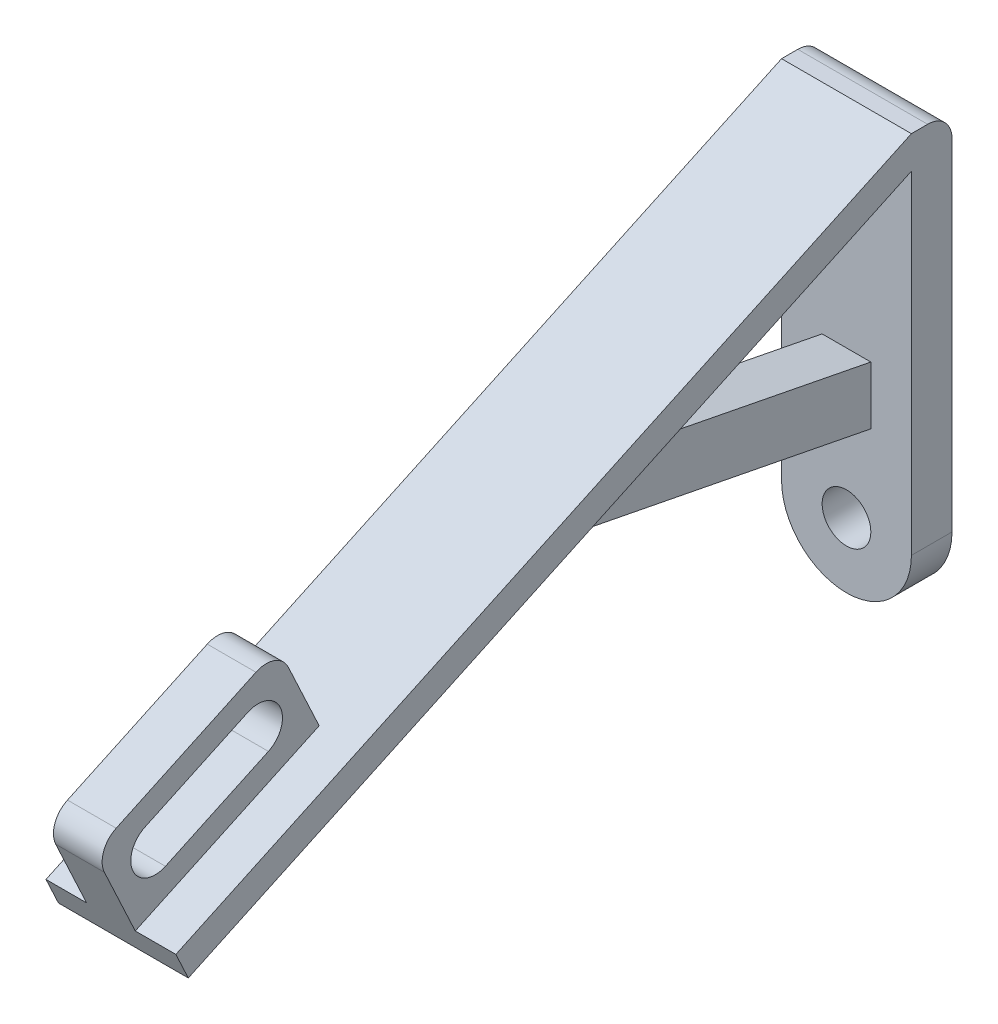
ISO-10303-21;
HEADER;
FILE_DESCRIPTION(('STEP AP214'),'2;1');
FILE_NAME('part.step','',(''),(''),'','','');
FILE_SCHEMA(('AUTOMOTIVE_DESIGN { 1 0 10303 214 1 1 1 1 }'));
ENDSEC;
DATA;
#1=APPLICATION_CONTEXT('core data for automotive mechanical design processes');
#2=APPLICATION_PROTOCOL_DEFINITION('international standard','automotive_design',2000,#1);
#3=PRODUCT_CONTEXT('',#1,'mechanical');
#4=PRODUCT('Part','Part','',(#3));
#5=PRODUCT_RELATED_PRODUCT_CATEGORY('part','',(#4));
#6=PRODUCT_DEFINITION_FORMATION('','',#4);
#7=PRODUCT_DEFINITION_CONTEXT('part definition',#1,'design');
#8=PRODUCT_DEFINITION('design','',#6,#7);
#9=PRODUCT_DEFINITION_SHAPE('','',#8);
#10=(LENGTH_UNIT() NAMED_UNIT(*) SI_UNIT(.MILLI.,.METRE.));
#11=(NAMED_UNIT(*) PLANE_ANGLE_UNIT() SI_UNIT($,.RADIAN.));
#12=(NAMED_UNIT(*) SI_UNIT($,.STERADIAN.) SOLID_ANGLE_UNIT());
#13=UNCERTAINTY_MEASURE_WITH_UNIT(LENGTH_MEASURE(1.E-05),#10,'distance_accuracy_value','');
#14=(GEOMETRIC_REPRESENTATION_CONTEXT(3) GLOBAL_UNCERTAINTY_ASSIGNED_CONTEXT((#13)) GLOBAL_UNIT_ASSIGNED_CONTEXT((#10,
#11,#12)) REPRESENTATION_CONTEXT('',''));
#15=CARTESIAN_POINT('',(0.,0.,0.));
#16=DIRECTION('',(0.,0.,1.));
#17=DIRECTION('',(1.,0.,0.));
#18=AXIS2_PLACEMENT_3D('',#15,#16,#17);
#19=CARTESIAN_POINT('',(0.,0.,5.));
#20=DIRECTION('',(0.,0.,1.));
#21=DIRECTION('',(1.,0.,0.));
#22=AXIS2_PLACEMENT_3D('',#19,#20,#21);
#23=PLANE('',#22);
#24=DIRECTION('',(0.,1.,0.));
#25=VECTOR('',#24,1.);
#26=CARTESIAN_POINT('',(-3.,18.1328109612648,5.));
#27=LINE('',#26,#25);
#28=CARTESIAN_POINT('',(-3.,11.,5.));
#29=VERTEX_POINT('',#28);
#30=CARTESIAN_POINT('',(-3.,18.1328109612648,5.));
#31=VERTEX_POINT('',#30);
#32=EDGE_CURVE('E257',#29,#31,#27,.T.);
#33=ORIENTED_EDGE('',*,*,#32,.T.);
#34=DIRECTION('',(1.,0.,0.));
#35=VECTOR('',#34,1.);
#36=CARTESIAN_POINT('',(-3.,18.1328109612648,5.));
#37=LINE('',#36,#35);
#38=CARTESIAN_POINT('',(3.,18.1328109612648,5.));
#39=VERTEX_POINT('',#38);
#40=EDGE_CURVE('E269',#31,#39,#37,.T.);
#41=ORIENTED_EDGE('',*,*,#40,.T.);
#42=DIRECTION('',(0.,1.,0.));
#43=VECTOR('',#42,1.);
#44=CARTESIAN_POINT('',(3.,18.1328109612648,5.));
#45=LINE('',#44,#43);
#46=CARTESIAN_POINT('',(3.,11.,5.));
#47=VERTEX_POINT('',#46);
#48=EDGE_CURVE('E248',#47,#39,#45,.T.);
#49=ORIENTED_EDGE('',*,*,#48,.F.);
#50=DIRECTION('',(1.,0.,0.));
#51=VECTOR('',#50,1.);
#52=CARTESIAN_POINT('',(-3.,11.,5.));
#53=LINE('',#52,#51);
#54=EDGE_CURVE('E270',#29,#47,#53,.T.);
#55=ORIENTED_EDGE('',*,*,#54,.F.);
#56=EDGE_LOOP('',(#33,#41,#49,#55));
#57=FACE_BOUND('',#56,.T.);
#58=CARTESIAN_POINT('',(0.,0.,5.));
#59=DIRECTION('',(0.,0.,1.));
#60=DIRECTION('',(1.,0.,0.));
#61=AXIS2_PLACEMENT_3D('',#58,#59,#60);
#62=CIRCLE('',#61,3.);
#63=CARTESIAN_POINT('',(3.,0.,5.));
#64=VERTEX_POINT('',#63);
#65=EDGE_CURVE('E308',#64,#64,#62,.T.);
#66=ORIENTED_EDGE('',*,*,#65,.F.);
#67=EDGE_LOOP('',(#66));
#68=FACE_BOUND('',#67,.T.);
#69=DIRECTION('',(0.,1.,0.));
#70=VECTOR('',#69,1.);
#71=CARTESIAN_POINT('',(8.,0.,5.));
#72=LINE('',#71,#70);
#73=CARTESIAN_POINT('',(8.,0.,5.));
#74=VERTEX_POINT('',#73);
#75=CARTESIAN_POINT('',(8.,41.,5.));
#76=VERTEX_POINT('',#75);
#77=EDGE_CURVE('E317',#74,#76,#72,.T.);
#78=ORIENTED_EDGE('',*,*,#77,.T.);
#79=DIRECTION('',(-1.,0.,0.));
#80=VECTOR('',#79,1.);
#81=CARTESIAN_POINT('',(8.,41.,5.));
#82=LINE('',#81,#80);
#83=CARTESIAN_POINT('',(-8.,41.,5.));
#84=VERTEX_POINT('',#83);
#85=EDGE_CURVE('E302',#76,#84,#82,.T.);
#86=ORIENTED_EDGE('',*,*,#85,.T.);
#87=DIRECTION('',(0.,-1.,0.));
#88=VECTOR('',#87,1.);
#89=CARTESIAN_POINT('',(-8.,0.,5.));
#90=LINE('',#89,#88);
#91=CARTESIAN_POINT('',(-8.,0.,5.));
#92=VERTEX_POINT('',#91);
#93=EDGE_CURVE('E323',#84,#92,#90,.T.);
#94=ORIENTED_EDGE('',*,*,#93,.T.);
#95=CARTESIAN_POINT('',(0.,0.,5.));
#96=DIRECTION('',(0.,0.,1.));
#97=DIRECTION('',(1.,0.,0.));
#98=AXIS2_PLACEMENT_3D('',#95,#96,#97);
#99=CIRCLE('',#98,8.);
#100=EDGE_CURVE('E314',#92,#74,#99,.T.);
#101=ORIENTED_EDGE('',*,*,#100,.T.);
#102=EDGE_LOOP('',(#78,#86,#94,#101));
#103=FACE_BOUND('',#102,.T.);
#104=ADVANCED_FACE('F33',(#57,#68,#103),#23,.T.);
#105=CARTESIAN_POINT('',(0.,0.,0.));
#106=DIRECTION('',(0.,0.,1.));
#107=DIRECTION('',(1.,0.,0.));
#108=AXIS2_PLACEMENT_3D('',#105,#106,#107);
#109=PLANE('',#108);
#110=DIRECTION('',(0.,-1.,0.));
#111=VECTOR('',#110,1.);
#112=CARTESIAN_POINT('',(-8.,0.,0.));
#113=LINE('',#112,#111);
#114=CARTESIAN_POINT('',(-8.,42.,0.));
#115=VERTEX_POINT('',#114);
#116=CARTESIAN_POINT('',(-8.,0.,0.));
#117=VERTEX_POINT('',#116);
#118=EDGE_CURVE('E318',#115,#117,#113,.T.);
#119=ORIENTED_EDGE('',*,*,#118,.F.);
#120=DIRECTION('',(-1.,0.,0.));
#121=VECTOR('',#120,1.);
#122=CARTESIAN_POINT('',(0.,42.,0.));
#123=LINE('',#122,#121);
#124=CARTESIAN_POINT('',(8.,42.,0.));
#125=VERTEX_POINT('',#124);
#126=EDGE_CURVE('E41',#115,#125,#123,.F.);
#127=ORIENTED_EDGE('',*,*,#126,.T.);
#128=DIRECTION('',(0.,1.,0.));
#129=VECTOR('',#128,1.);
#130=CARTESIAN_POINT('',(8.,0.,0.));
#131=LINE('',#130,#129);
#132=CARTESIAN_POINT('',(8.,0.,0.));
#133=VERTEX_POINT('',#132);
#134=EDGE_CURVE('E328',#133,#125,#131,.T.);
#135=ORIENTED_EDGE('',*,*,#134,.F.);
#136=CARTESIAN_POINT('',(0.,0.,0.));
#137=DIRECTION('',(0.,0.,1.));
#138=DIRECTION('',(1.,0.,0.));
#139=AXIS2_PLACEMENT_3D('',#136,#137,#138);
#140=CIRCLE('',#139,8.);
#141=EDGE_CURVE('E311',#117,#133,#140,.T.);
#142=ORIENTED_EDGE('',*,*,#141,.F.);
#143=EDGE_LOOP('',(#119,#127,#135,#142));
#144=FACE_BOUND('',#143,.T.);
#145=CARTESIAN_POINT('',(0.,0.,0.));
#146=DIRECTION('',(0.,0.,1.));
#147=DIRECTION('',(1.,0.,0.));
#148=AXIS2_PLACEMENT_3D('',#145,#146,#147);
#149=CIRCLE('',#148,3.);
#150=CARTESIAN_POINT('',(3.,0.,0.));
#151=VERTEX_POINT('',#150);
#152=EDGE_CURVE('E301',#151,#151,#149,.T.);
#153=ORIENTED_EDGE('',*,*,#152,.T.);
#154=EDGE_LOOP('',(#153));
#155=FACE_BOUND('',#154,.T.);
#156=ADVANCED_FACE('F389',(#144,#155),#109,.F.);
#157=CARTESIAN_POINT('',(0.,0.,5.));
#158=DIRECTION('',(0.,0.,-1.));
#159=DIRECTION('',(-1.,0.,0.));
#160=AXIS2_PLACEMENT_3D('',#157,#158,#159);
#161=CYLINDRICAL_SURFACE('',#160,8.);
#162=ORIENTED_EDGE('',*,*,#141,.T.);
#163=DIRECTION('',(0.,0.,-1.));
#164=VECTOR('',#163,1.);
#165=CARTESIAN_POINT('',(8.,0.,5.));
#166=LINE('',#165,#164);
#167=EDGE_CURVE('E338',#74,#133,#166,.T.);
#168=ORIENTED_EDGE('',*,*,#167,.F.);
#169=ORIENTED_EDGE('',*,*,#100,.F.);
#170=DIRECTION('',(0.,0.,-1.));
#171=VECTOR('',#170,1.);
#172=CARTESIAN_POINT('',(-8.,0.,5.));
#173=LINE('',#172,#171);
#174=EDGE_CURVE('E325',#92,#117,#173,.T.);
#175=ORIENTED_EDGE('',*,*,#174,.T.);
#176=EDGE_LOOP('',(#162,#168,#169,#175));
#177=FACE_BOUND('',#176,.T.);
#178=ADVANCED_FACE('F395',(#177),#161,.T.);
#179=CARTESIAN_POINT('',(8.,0.,5.));
#180=DIRECTION('',(-1.,0.,0.));
#181=DIRECTION('',(0.,0.,1.));
#182=AXIS2_PLACEMENT_3D('',#179,#180,#181);
#183=PLANE('',#182);
#184=ORIENTED_EDGE('',*,*,#134,.T.);
#185=CARTESIAN_POINT('',(8.,42.,3.));
#186=DIRECTION('',(-1.,0.,0.));
#187=DIRECTION('',(0.,0.,1.));
#188=AXIS2_PLACEMENT_3D('',#185,#186,#187);
#189=CIRCLE('',#188,3.);
#190=CARTESIAN_POINT('',(8.,45.,3.));
#191=VERTEX_POINT('',#190);
#192=EDGE_CURVE('E11',#125,#191,#189,.F.);
#193=ORIENTED_EDGE('',*,*,#192,.T.);
#194=DIRECTION('',(0.,0.,-1.));
#195=VECTOR('',#194,1.);
#196=CARTESIAN_POINT('',(8.,45.,5.));
#197=LINE('',#196,#195);
#198=CARTESIAN_POINT('',(8.,45.,5.));
#199=VERTEX_POINT('',#198);
#200=EDGE_CURVE('E335',#199,#191,#197,.T.);
#201=ORIENTED_EDGE('',*,*,#200,.F.);
#202=DIRECTION('',(0.,0.422618261740704,-0.906307787036648));
#203=VECTOR('',#202,1.);
#204=CARTESIAN_POINT('',(8.,45.,5.));
#205=LINE('',#204,#203);
#206=CARTESIAN_POINT('',(8.,2.73817382592963,95.6307787036648));
#207=VERTEX_POINT('',#206);
#208=EDGE_CURVE('E285',#207,#199,#205,.T.);
#209=ORIENTED_EDGE('',*,*,#208,.F.);
#210=DIRECTION('',(0.,0.906307787036648,0.422618261740703));
#211=VECTOR('',#210,1.);
#212=CARTESIAN_POINT('',(8.,2.73817382592963,95.6307787036648));
#213=LINE('',#212,#211);
#214=CARTESIAN_POINT('',(8.,-0.547401393443451,94.0986898174268));
#215=VERTEX_POINT('',#214);
#216=EDGE_CURVE('E282',#215,#207,#213,.T.);
#217=ORIENTED_EDGE('',*,*,#216,.F.);
#218=DIRECTION('',(0.,-0.422618261740704,0.906307787036648));
#219=VECTOR('',#218,1.);
#220=CARTESIAN_POINT('',(8.,-0.547401393443451,94.0986898174268));
#221=LINE('',#220,#219);
#222=EDGE_CURVE('E288',#76,#215,#221,.T.);
#223=ORIENTED_EDGE('',*,*,#222,.F.);
#224=ORIENTED_EDGE('',*,*,#77,.F.);
#225=ORIENTED_EDGE('',*,*,#167,.T.);
#226=EDGE_LOOP('',(#184,#193,#201,#209,#217,#223,#224,#225));
#227=FACE_BOUND('',#226,.T.);
#228=ADVANCED_FACE('F380',(#227),#183,.F.);
#229=CARTESIAN_POINT('',(-8.,45.,5.));
#230=DIRECTION('',(0.,-1.,0.));
#231=DIRECTION('',(0.,0.,-1.));
#232=AXIS2_PLACEMENT_3D('',#229,#230,#231);
#233=PLANE('',#232);
#234=ORIENTED_EDGE('',*,*,#200,.T.);
#235=DIRECTION('',(-1.,0.,0.));
#236=VECTOR('',#235,1.);
#237=CARTESIAN_POINT('',(-8.,45.,3.));
#238=LINE('',#237,#236);
#239=CARTESIAN_POINT('',(-8.,45.,3.));
#240=VERTEX_POINT('',#239);
#241=EDGE_CURVE('E359',#191,#240,#238,.T.);
#242=ORIENTED_EDGE('',*,*,#241,.T.);
#243=DIRECTION('',(0.,0.,-1.));
#244=VECTOR('',#243,1.);
#245=CARTESIAN_POINT('',(-8.,45.,5.));
#246=LINE('',#245,#244);
#247=CARTESIAN_POINT('',(-8.,45.,5.));
#248=VERTEX_POINT('',#247);
#249=EDGE_CURVE('E333',#248,#240,#246,.T.);
#250=ORIENTED_EDGE('',*,*,#249,.F.);
#251=DIRECTION('',(-1.,0.,0.));
#252=VECTOR('',#251,1.);
#253=CARTESIAN_POINT('',(-8.,45.,5.));
#254=LINE('',#253,#252);
#255=EDGE_CURVE('E321',#199,#248,#254,.T.);
#256=ORIENTED_EDGE('',*,*,#255,.F.);
#257=EDGE_LOOP('',(#234,#242,#250,#256));
#258=FACE_BOUND('',#257,.T.);
#259=ADVANCED_FACE('F365',(#258),#233,.F.);
#260=CARTESIAN_POINT('',(-8.,0.,5.));
#261=DIRECTION('',(1.,0.,0.));
#262=DIRECTION('',(0.,0.,-1.));
#263=AXIS2_PLACEMENT_3D('',#260,#261,#262);
#264=PLANE('',#263);
#265=ORIENTED_EDGE('',*,*,#249,.T.);
#266=CARTESIAN_POINT('',(-8.,42.,3.));
#267=DIRECTION('',(1.,0.,0.));
#268=DIRECTION('',(0.,0.,-1.));
#269=AXIS2_PLACEMENT_3D('',#266,#267,#268);
#270=CIRCLE('',#269,3.);
#271=EDGE_CURVE('E55',#240,#115,#270,.F.);
#272=ORIENTED_EDGE('',*,*,#271,.T.);
#273=ORIENTED_EDGE('',*,*,#118,.T.);
#274=ORIENTED_EDGE('',*,*,#174,.F.);
#275=ORIENTED_EDGE('',*,*,#93,.F.);
#276=DIRECTION('',(0.,-0.422618261740704,0.906307787036648));
#277=VECTOR('',#276,1.);
#278=CARTESIAN_POINT('',(-8.,-0.547401393443451,94.0986898174268));
#279=LINE('',#278,#277);
#280=CARTESIAN_POINT('',(-8.,-0.547401393443451,94.0986898174268));
#281=VERTEX_POINT('',#280);
#282=EDGE_CURVE('E286',#84,#281,#279,.T.);
#283=ORIENTED_EDGE('',*,*,#282,.T.);
#284=DIRECTION('',(0.,0.906307787036648,0.422618261740703));
#285=VECTOR('',#284,1.);
#286=CARTESIAN_POINT('',(-8.,2.73817382592963,95.6307787036648));
#287=LINE('',#286,#285);
#288=CARTESIAN_POINT('',(-8.,2.73817382592963,95.6307787036648));
#289=VERTEX_POINT('',#288);
#290=EDGE_CURVE('E273',#281,#289,#287,.T.);
#291=ORIENTED_EDGE('',*,*,#290,.T.);
#292=DIRECTION('',(0.,0.422618261740704,-0.906307787036648));
#293=VECTOR('',#292,1.);
#294=CARTESIAN_POINT('',(-8.,45.,5.));
#295=LINE('',#294,#293);
#296=EDGE_CURVE('E294',#289,#248,#295,.T.);
#297=ORIENTED_EDGE('',*,*,#296,.T.);
#298=EDGE_LOOP('',(#265,#272,#273,#274,#275,#283,#291,#297));
#299=FACE_BOUND('',#298,.T.);
#300=ADVANCED_FACE('F370',(#299),#264,.F.);
#301=CARTESIAN_POINT('',(0.,0.,5.));
#302=DIRECTION('',(0.,0.,-1.));
#303=DIRECTION('',(-1.,0.,0.));
#304=AXIS2_PLACEMENT_3D('',#301,#302,#303);
#305=CYLINDRICAL_SURFACE('',#304,3.);
#306=ORIENTED_EDGE('',*,*,#65,.T.);
#307=EDGE_LOOP('',(#306));
#308=FACE_BOUND('',#307,.T.);
#309=ORIENTED_EDGE('',*,*,#152,.F.);
#310=EDGE_LOOP('',(#309));
#311=FACE_BOUND('',#310,.T.);
#312=ADVANCED_FACE('F399',(#308,#311),#305,.F.);
#313=CARTESIAN_POINT('',(8.,2.73817382592963,95.6307787036648));
#314=DIRECTION('',(0.,-0.422618261740703,0.906307787036648));
#315=DIRECTION('',(0.,-0.906307787036648,-0.422618261740703));
#316=AXIS2_PLACEMENT_3D('',#313,#314,#315);
#317=PLANE('',#316);
#318=DIRECTION('',(0.,-0.906307787036648,-0.422618261740703));
#319=VECTOR('',#318,1.);
#320=CARTESIAN_POINT('',(3.,2.73817382592963,95.6307787036648));
#321=LINE('',#320,#319);
#322=CARTESIAN_POINT('',(3.,10.8949439092595,99.4343430593311));
#323=VERTEX_POINT('',#322);
#324=CARTESIAN_POINT('',(3.,2.73817382592963,95.6307787036648));
#325=VERTEX_POINT('',#324);
#326=EDGE_CURVE('E220',#323,#325,#321,.T.);
#327=ORIENTED_EDGE('',*,*,#326,.F.);
#328=DIRECTION('',(1.,0.,0.));
#329=VECTOR('',#328,1.);
#330=CARTESIAN_POINT('',(8.,10.8949439092595,99.4343430593311));
#331=LINE('',#330,#329);
#332=CARTESIAN_POINT('',(-3.,10.8949439092595,99.4343430593311));
#333=VERTEX_POINT('',#332);
#334=EDGE_CURVE('E350',#323,#333,#331,.F.);
#335=ORIENTED_EDGE('',*,*,#334,.T.);
#336=DIRECTION('',(0.,-0.906307787036648,-0.422618261740703));
#337=VECTOR('',#336,1.);
#338=CARTESIAN_POINT('',(-3.,2.73817382592963,95.6307787036648));
#339=LINE('',#338,#337);
#340=CARTESIAN_POINT('',(-3.,2.73817382592963,95.6307787036648));
#341=VERTEX_POINT('',#340);
#342=EDGE_CURVE('E243',#333,#341,#339,.T.);
#343=ORIENTED_EDGE('',*,*,#342,.T.);
#344=DIRECTION('',(-1.,0.,0.));
#345=VECTOR('',#344,1.);
#346=CARTESIAN_POINT('',(8.,2.73817382592963,95.6307787036648));
#347=LINE('',#346,#345);
#348=EDGE_CURVE('E291',#341,#289,#347,.T.);
#349=ORIENTED_EDGE('',*,*,#348,.T.);
#350=ORIENTED_EDGE('',*,*,#290,.F.);
#351=DIRECTION('',(-1.,0.,0.));
#352=VECTOR('',#351,1.);
#353=CARTESIAN_POINT('',(8.,-0.547401393443451,94.0986898174268));
#354=LINE('',#353,#352);
#355=EDGE_CURVE('E299',#215,#281,#354,.T.);
#356=ORIENTED_EDGE('',*,*,#355,.F.);
#357=ORIENTED_EDGE('',*,*,#216,.T.);
#358=EDGE_CURVE('E305',#207,#325,#347,.T.);
#359=ORIENTED_EDGE('',*,*,#358,.T.);
#360=EDGE_LOOP('',(#327,#335,#343,#349,#350,#356,#357,#359));
#361=FACE_BOUND('',#360,.T.);
#362=ADVANCED_FACE('F437',(#361),#317,.T.);
#363=CARTESIAN_POINT('',(8.,-0.547401393443451,94.0986898174268));
#364=DIRECTION('',(0.,-0.906307787036648,-0.422618261740704));
#365=DIRECTION('',(0.,0.422618261740704,-0.906307787036648));
#366=AXIS2_PLACEMENT_3D('',#363,#364,#365);
#367=PLANE('',#366);
#368=DIRECTION('',(0.,-0.422618261740704,0.906307787036648));
#369=VECTOR('',#368,1.);
#370=CARTESIAN_POINT('',(-3.,24.8931805292561,39.5411858224079));
#371=LINE('',#370,#369);
#372=CARTESIAN_POINT('',(-3.,24.8931805292561,39.5411858224079));
#373=VERTEX_POINT('',#372);
#374=CARTESIAN_POINT('',(-3.,19.8690869129648,50.3153893518324));
#375=VERTEX_POINT('',#374);
#376=EDGE_CURVE('E263',#373,#375,#371,.T.);
#377=ORIENTED_EDGE('',*,*,#376,.T.);
#378=DIRECTION('',(1.,0.,0.));
#379=VECTOR('',#378,1.);
#380=CARTESIAN_POINT('',(-3.,19.8690869129648,50.3153893518324));
#381=LINE('',#380,#379);
#382=CARTESIAN_POINT('',(3.,19.8690869129648,50.3153893518324));
#383=VERTEX_POINT('',#382);
#384=EDGE_CURVE('E274',#375,#383,#381,.T.);
#385=ORIENTED_EDGE('',*,*,#384,.T.);
#386=DIRECTION('',(0.,-0.422618261740704,0.906307787036648));
#387=VECTOR('',#386,1.);
#388=CARTESIAN_POINT('',(3.,24.8931805292561,39.5411858224079));
#389=LINE('',#388,#387);
#390=CARTESIAN_POINT('',(3.,24.8931805292561,39.5411858224079));
#391=VERTEX_POINT('',#390);
#392=EDGE_CURVE('E253',#391,#383,#389,.T.);
#393=ORIENTED_EDGE('',*,*,#392,.F.);
#394=DIRECTION('',(1.,0.,0.));
#395=VECTOR('',#394,1.);
#396=CARTESIAN_POINT('',(-3.,24.8931805292561,39.5411858224079));
#397=LINE('',#396,#395);
#398=EDGE_CURVE('E277',#373,#391,#397,.T.);
#399=ORIENTED_EDGE('',*,*,#398,.F.);
#400=EDGE_LOOP('',(#377,#385,#393,#399));
#401=FACE_BOUND('',#400,.T.);
#402=ORIENTED_EDGE('',*,*,#282,.F.);
#403=ORIENTED_EDGE('',*,*,#85,.F.);
#404=ORIENTED_EDGE('',*,*,#222,.T.);
#405=ORIENTED_EDGE('',*,*,#355,.T.);
#406=EDGE_LOOP('',(#402,#403,#404,#405));
#407=FACE_BOUND('',#406,.T.);
#408=ADVANCED_FACE('F440',(#401,#407),#367,.T.);
#409=CARTESIAN_POINT('',(8.,45.,5.));
#410=DIRECTION('',(0.,0.906307787036648,0.422618261740704));
#411=DIRECTION('',(0.,-0.422618261740704,0.906307787036648));
#412=AXIS2_PLACEMENT_3D('',#409,#410,#411);
#413=PLANE('',#412);
#414=DIRECTION('',(0.,0.422618261740704,-0.906307787036648));
#415=VECTOR('',#414,1.);
#416=CARTESIAN_POINT('',(-3.,13.3036303694472,72.9730840277486));
#417=LINE('',#416,#415);
#418=CARTESIAN_POINT('',(-3.,13.3036303694472,72.9730840277486));
#419=VERTEX_POINT('',#418);
#420=EDGE_CURVE('E231',#341,#419,#417,.T.);
#421=ORIENTED_EDGE('',*,*,#420,.T.);
#422=DIRECTION('',(1.,0.,0.));
#423=VECTOR('',#422,1.);
#424=CARTESIAN_POINT('',(-3.,13.3036303694472,72.9730840277486));
#425=LINE('',#424,#423);
#426=CARTESIAN_POINT('',(3.,13.3036303694472,72.9730840277486));
#427=VERTEX_POINT('',#426);
#428=EDGE_CURVE('E245',#419,#427,#425,.T.);
#429=ORIENTED_EDGE('',*,*,#428,.T.);
#430=DIRECTION('',(0.,0.422618261740704,-0.906307787036648));
#431=VECTOR('',#430,1.);
#432=CARTESIAN_POINT('',(3.,13.3036303694472,72.9730840277486));
#433=LINE('',#432,#431);
#434=EDGE_CURVE('E211',#325,#427,#433,.T.);
#435=ORIENTED_EDGE('',*,*,#434,.F.);
#436=ORIENTED_EDGE('',*,*,#358,.F.);
#437=ORIENTED_EDGE('',*,*,#208,.T.);
#438=ORIENTED_EDGE('',*,*,#255,.T.);
#439=ORIENTED_EDGE('',*,*,#296,.F.);
#440=ORIENTED_EDGE('',*,*,#348,.F.);
#441=EDGE_LOOP('',(#421,#429,#435,#436,#437,#438,#439,#440));
#442=FACE_BOUND('',#441,.T.);
#443=ADVANCED_FACE('F375',(#442),#413,.T.);
#444=CARTESIAN_POINT('',(-3.,11.,5.));
#445=DIRECTION('',(0.,-0.981380277426938,0.192074858004438));
#446=DIRECTION('',(0.,-0.192074858004438,-0.981380277426939));
#447=AXIS2_PLACEMENT_3D('',#444,#445,#446);
#448=PLANE('',#447);
#449=ORIENTED_EDGE('',*,*,#54,.T.);
#450=DIRECTION('',(0.,-0.192074858004438,-0.981380277426938));
#451=VECTOR('',#450,1.);
#452=CARTESIAN_POINT('',(3.,11.,5.));
#453=LINE('',#452,#451);
#454=EDGE_CURVE('E255',#383,#47,#453,.T.);
#455=ORIENTED_EDGE('',*,*,#454,.F.);
#456=ORIENTED_EDGE('',*,*,#384,.F.);
#457=DIRECTION('',(0.,-0.192074858004438,-0.981380277426938));
#458=VECTOR('',#457,1.);
#459=CARTESIAN_POINT('',(-3.,11.,5.));
#460=LINE('',#459,#458);
#461=EDGE_CURVE('E266',#375,#29,#460,.T.);
#462=ORIENTED_EDGE('',*,*,#461,.T.);
#463=EDGE_LOOP('',(#449,#455,#456,#462));
#464=FACE_BOUND('',#463,.T.);
#465=ADVANCED_FACE('F463',(#464),#448,.T.);
#466=CARTESIAN_POINT('',(-3.,18.1328109612648,5.));
#467=DIRECTION('',(0.,0.981380277426938,-0.192074858004438));
#468=DIRECTION('',(0.,0.192074858004438,0.981380277426939));
#469=AXIS2_PLACEMENT_3D('',#466,#467,#468);
#470=PLANE('',#469);
#471=ORIENTED_EDGE('',*,*,#398,.T.);
#472=DIRECTION('',(0.,0.192074858004438,0.981380277426939));
#473=VECTOR('',#472,1.);
#474=CARTESIAN_POINT('',(3.,18.1328109612648,5.));
#475=LINE('',#474,#473);
#476=EDGE_CURVE('E251',#39,#391,#475,.T.);
#477=ORIENTED_EDGE('',*,*,#476,.F.);
#478=ORIENTED_EDGE('',*,*,#40,.F.);
#479=DIRECTION('',(0.,0.192074858004438,0.981380277426939));
#480=VECTOR('',#479,1.);
#481=CARTESIAN_POINT('',(-3.,18.1328109612648,5.));
#482=LINE('',#481,#480);
#483=EDGE_CURVE('E260',#31,#373,#482,.T.);
#484=ORIENTED_EDGE('',*,*,#483,.T.);
#485=EDGE_LOOP('',(#471,#477,#478,#484));
#486=FACE_BOUND('',#485,.T.);
#487=ADVANCED_FACE('F465',(#486),#470,.T.);
#488=CARTESIAN_POINT('',(-3.,0.,0.));
#489=DIRECTION('',(-1.,0.,0.));
#490=DIRECTION('',(0.,0.,1.));
#491=AXIS2_PLACEMENT_3D('',#488,#489,#490);
#492=PLANE('',#491);
#493=ORIENTED_EDGE('',*,*,#32,.F.);
#494=ORIENTED_EDGE('',*,*,#461,.F.);
#495=ORIENTED_EDGE('',*,*,#376,.F.);
#496=ORIENTED_EDGE('',*,*,#483,.F.);
#497=EDGE_LOOP('',(#493,#494,#495,#496));
#498=FACE_BOUND('',#497,.T.);
#499=ADVANCED_FACE('F468',(#498),#492,.T.);
#500=CARTESIAN_POINT('',(3.,0.,0.));
#501=DIRECTION('',(-1.,0.,0.));
#502=DIRECTION('',(0.,0.,1.));
#503=AXIS2_PLACEMENT_3D('',#500,#501,#502);
#504=PLANE('',#503);
#505=ORIENTED_EDGE('',*,*,#48,.T.);
#506=ORIENTED_EDGE('',*,*,#476,.T.);
#507=ORIENTED_EDGE('',*,*,#392,.T.);
#508=ORIENTED_EDGE('',*,*,#454,.T.);
#509=EDGE_LOOP('',(#505,#506,#507,#508));
#510=FACE_BOUND('',#509,.T.);
#511=ADVANCED_FACE('F475',(#510),#504,.F.);
#512=CARTESIAN_POINT('',(-3.,13.6138672703694,100.702197844553));
#513=DIRECTION('',(0.,0.906307787036648,0.422618261740704));
#514=DIRECTION('',(0.,-0.422618261740704,0.906307787036648));
#515=AXIS2_PLACEMENT_3D('',#512,#513,#514);
#516=PLANE('',#515);
#517=DIRECTION('',(0.,-0.422618261740704,0.906307787036648));
#518=VECTOR('',#517,1.);
#519=CARTESIAN_POINT('',(-3.,13.6138672703694,100.702197844553));
#520=LINE('',#519,#518);
#521=CARTESIAN_POINT('',(-3.,22.9114690286649,80.763426529747));
#522=VERTEX_POINT('',#521);
#523=CARTESIAN_POINT('',(-3.,14.8817220555915,97.9832744834433));
#524=VERTEX_POINT('',#523);
#525=EDGE_CURVE('E240',#522,#524,#520,.T.);
#526=ORIENTED_EDGE('',*,*,#525,.T.);
#527=DIRECTION('',(1.,0.,0.));
#528=VECTOR('',#527,1.);
#529=CARTESIAN_POINT('',(-3.,14.8817220555915,97.9832744834433));
#530=LINE('',#529,#528);
#531=CARTESIAN_POINT('',(3.,14.8817220555915,97.9832744834433));
#532=VERTEX_POINT('',#531);
#533=EDGE_CURVE('E343',#524,#532,#530,.T.);
#534=ORIENTED_EDGE('',*,*,#533,.T.);
#535=DIRECTION('',(0.,-0.422618261740704,0.906307787036648));
#536=VECTOR('',#535,1.);
#537=CARTESIAN_POINT('',(3.,13.6138672703694,100.702197844553));
#538=LINE('',#537,#536);
#539=CARTESIAN_POINT('',(3.,22.9114690286649,80.763426529747));
#540=VERTEX_POINT('',#539);
#541=EDGE_CURVE('E217',#540,#532,#538,.T.);
#542=ORIENTED_EDGE('',*,*,#541,.F.);
#543=DIRECTION('',(1.,0.,0.));
#544=VECTOR('',#543,1.);
#545=CARTESIAN_POINT('',(-3.,22.9114690286649,80.763426529747));
#546=LINE('',#545,#544);
#547=EDGE_CURVE('E341',#540,#522,#546,.F.);
#548=ORIENTED_EDGE('',*,*,#547,.T.);
#549=EDGE_LOOP('',(#526,#534,#542,#548));
#550=FACE_BOUND('',#549,.T.);
#551=ADVANCED_FACE('F428',(#550),#516,.T.);
#552=CARTESIAN_POINT('',(-3.,24.179323813887,78.0445031686371));
#553=DIRECTION('',(0.,0.422618261740703,-0.906307787036648));
#554=DIRECTION('',(0.,0.906307787036648,0.422618261740703));
#555=AXIS2_PLACEMENT_3D('',#552,#553,#554);
#556=PLANE('',#555);
#557=DIRECTION('',(0.,0.906307787036648,0.422618261740703));
#558=VECTOR('',#557,1.);
#559=CARTESIAN_POINT('',(-3.,24.179323813887,78.0445031686371));
#560=LINE('',#559,#558);
#561=CARTESIAN_POINT('',(-3.,21.4604004527771,76.776648383415));
#562=VERTEX_POINT('',#561);
#563=EDGE_CURVE('E237',#419,#562,#560,.T.);
#564=ORIENTED_EDGE('',*,*,#563,.T.);
#565=DIRECTION('',(1.,0.,0.));
#566=VECTOR('',#565,1.);
#567=CARTESIAN_POINT('',(-3.,21.4604004527771,76.776648383415));
#568=LINE('',#567,#566);
#569=CARTESIAN_POINT('',(3.,21.4604004527771,76.776648383415));
#570=VERTEX_POINT('',#569);
#571=EDGE_CURVE('E356',#562,#570,#568,.T.);
#572=ORIENTED_EDGE('',*,*,#571,.T.);
#573=DIRECTION('',(0.,0.906307787036648,0.422618261740703));
#574=VECTOR('',#573,1.);
#575=CARTESIAN_POINT('',(3.,24.179323813887,78.0445031686371));
#576=LINE('',#575,#574);
#577=EDGE_CURVE('E214',#427,#570,#576,.T.);
#578=ORIENTED_EDGE('',*,*,#577,.F.);
#579=ORIENTED_EDGE('',*,*,#428,.F.);
#580=EDGE_LOOP('',(#564,#572,#578,#579));
#581=FACE_BOUND('',#580,.T.);
#582=ADVANCED_FACE('F434',(#581),#556,.T.);
#583=CARTESIAN_POINT('',(-3.,0.,0.));
#584=DIRECTION('',(-1.,0.,0.));
#585=DIRECTION('',(0.,0.,1.));
#586=AXIS2_PLACEMENT_3D('',#583,#584,#585);
#587=PLANE('',#586);
#588=CARTESIAN_POINT('',(-3.,16.4170766520932,80.4934864268944));
#589=DIRECTION('',(1.,0.,0.));
#590=DIRECTION('',(0.,0.,-1.));
#591=AXIS2_PLACEMENT_3D('',#588,#589,#590);
#592=CIRCLE('',#591,2.99999999999999);
#593=CARTESIAN_POINT('',(-3.,13.6981532909833,79.2256316416723));
#594=VERTEX_POINT('',#593);
#595=CARTESIAN_POINT('',(-3.,19.1360000132032,81.7613412121165));
#596=VERTEX_POINT('',#595);
#597=EDGE_CURVE('E222',#594,#596,#592,.T.);
#598=ORIENTED_EDGE('',*,*,#597,.T.);
#599=DIRECTION('',(0.,-0.422618261740704,0.906307787036648));
#600=VECTOR('',#599,1.);
#601=CARTESIAN_POINT('',(-3.,19.1360000132032,81.7613412121165));
#602=LINE('',#601,#600);
#603=CARTESIAN_POINT('',(-3.,13.2193443488333,94.4496502306296));
#604=VERTEX_POINT('',#603);
#605=EDGE_CURVE('E188',#596,#604,#602,.T.);
#606=ORIENTED_EDGE('',*,*,#605,.T.);
#607=CARTESIAN_POINT('',(-3.,10.5004209877234,93.1817954454075));
#608=DIRECTION('',(1.,0.,0.));
#609=DIRECTION('',(0.,0.,-1.));
#610=AXIS2_PLACEMENT_3D('',#607,#608,#609);
#611=CIRCLE('',#610,2.99999999999999);
#612=CARTESIAN_POINT('',(-3.,7.78149762661345,91.9139406601854));
#613=VERTEX_POINT('',#612);
#614=EDGE_CURVE('E225',#604,#613,#611,.T.);
#615=ORIENTED_EDGE('',*,*,#614,.T.);
#616=DIRECTION('',(0.,0.422618261740704,-0.906307787036648));
#617=VECTOR('',#616,1.);
#618=CARTESIAN_POINT('',(-3.,13.6981532909833,79.2256316416723));
#619=LINE('',#618,#617);
#620=EDGE_CURVE('E193',#613,#594,#619,.T.);
#621=ORIENTED_EDGE('',*,*,#620,.T.);
#622=EDGE_LOOP('',(#598,#606,#615,#621));
#623=FACE_BOUND('',#622,.T.);
#624=ORIENTED_EDGE('',*,*,#342,.F.);
#625=CARTESIAN_POINT('',(-3.,12.1627986944816,96.7154196982212));
#626=DIRECTION('',(-1.,0.,0.));
#627=DIRECTION('',(0.,0.,1.));
#628=AXIS2_PLACEMENT_3D('',#625,#626,#627);
#629=CIRCLE('',#628,3.);
#630=EDGE_CURVE('E354',#333,#524,#629,.T.);
#631=ORIENTED_EDGE('',*,*,#630,.T.);
#632=ORIENTED_EDGE('',*,*,#525,.F.);
#633=CARTESIAN_POINT('',(-3.,20.192545667555,79.4955717445249));
#634=DIRECTION('',(-1.,0.,0.));
#635=DIRECTION('',(0.,0.,1.));
#636=AXIS2_PLACEMENT_3D('',#633,#634,#635);
#637=CIRCLE('',#636,3.);
#638=EDGE_CURVE('E352',#522,#562,#637,.T.);
#639=ORIENTED_EDGE('',*,*,#638,.T.);
#640=ORIENTED_EDGE('',*,*,#563,.F.);
#641=ORIENTED_EDGE('',*,*,#420,.F.);
#642=EDGE_LOOP('',(#624,#631,#632,#639,#640,#641));
#643=FACE_BOUND('',#642,.T.);
#644=ADVANCED_FACE('F424',(#623,#643),#587,.T.);
#645=CARTESIAN_POINT('',(-3.,16.4170766520932,80.4934864268944));
#646=DIRECTION('',(1.,0.,0.));
#647=DIRECTION('',(0.,0.,-1.));
#648=AXIS2_PLACEMENT_3D('',#645,#646,#647);
#649=CYLINDRICAL_SURFACE('',#648,2.99999999999999);
#650=DIRECTION('',(1.,0.,0.));
#651=VECTOR('',#650,1.);
#652=CARTESIAN_POINT('',(-3.,13.6981532909833,79.2256316416723));
#653=LINE('',#652,#651);
#654=CARTESIAN_POINT('',(3.,13.6981532909833,79.2256316416723));
#655=VERTEX_POINT('',#654);
#656=EDGE_CURVE('E198',#594,#655,#653,.T.);
#657=ORIENTED_EDGE('',*,*,#656,.T.);
#658=CARTESIAN_POINT('',(3.,16.4170766520932,80.4934864268944));
#659=DIRECTION('',(1.,0.,0.));
#660=DIRECTION('',(0.,0.,-1.));
#661=AXIS2_PLACEMENT_3D('',#658,#659,#660);
#662=CIRCLE('',#661,2.99999999999999);
#663=CARTESIAN_POINT('',(3.,19.1360000132032,81.7613412121165));
#664=VERTEX_POINT('',#663);
#665=EDGE_CURVE('E196',#655,#664,#662,.T.);
#666=ORIENTED_EDGE('',*,*,#665,.T.);
#667=DIRECTION('',(1.,0.,0.));
#668=VECTOR('',#667,1.);
#669=CARTESIAN_POINT('',(-3.,19.1360000132032,81.7613412121165));
#670=LINE('',#669,#668);
#671=EDGE_CURVE('E180',#596,#664,#670,.T.);
#672=ORIENTED_EDGE('',*,*,#671,.F.);
#673=ORIENTED_EDGE('',*,*,#597,.F.);
#674=EDGE_LOOP('',(#657,#666,#672,#673));
#675=FACE_BOUND('',#674,.T.);
#676=ADVANCED_FACE('F197',(#675),#649,.F.);
#677=CARTESIAN_POINT('',(-3.,13.6981532909833,79.2256316416723));
#678=DIRECTION('',(0.,-0.906307787036648,-0.422618261740704));
#679=DIRECTION('',(0.,0.422618261740704,-0.906307787036648));
#680=AXIS2_PLACEMENT_3D('',#677,#678,#679);
#681=PLANE('',#680);
#682=DIRECTION('',(1.,0.,0.));
#683=VECTOR('',#682,1.);
#684=CARTESIAN_POINT('',(-3.,7.78149762661345,91.9139406601854));
#685=LINE('',#684,#683);
#686=CARTESIAN_POINT('',(3.,7.78149762661345,91.9139406601854));
#687=VERTEX_POINT('',#686);
#688=EDGE_CURVE('E232',#613,#687,#685,.T.);
#689=ORIENTED_EDGE('',*,*,#688,.T.);
#690=DIRECTION('',(0.,0.422618261740704,-0.906307787036648));
#691=VECTOR('',#690,1.);
#692=CARTESIAN_POINT('',(3.,13.6981532909833,79.2256316416723));
#693=LINE('',#692,#691);
#694=EDGE_CURVE('E207',#687,#655,#693,.T.);
#695=ORIENTED_EDGE('',*,*,#694,.T.);
#696=ORIENTED_EDGE('',*,*,#656,.F.);
#697=ORIENTED_EDGE('',*,*,#620,.F.);
#698=EDGE_LOOP('',(#689,#695,#696,#697));
#699=FACE_BOUND('',#698,.T.);
#700=ADVANCED_FACE('F489',(#699),#681,.F.);
#701=CARTESIAN_POINT('',(-3.,10.5004209877234,93.1817954454075));
#702=DIRECTION('',(1.,0.,0.));
#703=DIRECTION('',(0.,0.,-1.));
#704=AXIS2_PLACEMENT_3D('',#701,#702,#703);
#705=CYLINDRICAL_SURFACE('',#704,2.99999999999999);
#706=DIRECTION('',(1.,0.,0.));
#707=VECTOR('',#706,1.);
#708=CARTESIAN_POINT('',(-3.,13.2193443488333,94.4496502306296));
#709=LINE('',#708,#707);
#710=CARTESIAN_POINT('',(3.,13.2193443488333,94.4496502306296));
#711=VERTEX_POINT('',#710);
#712=EDGE_CURVE('E192',#604,#711,#709,.T.);
#713=ORIENTED_EDGE('',*,*,#712,.T.);
#714=CARTESIAN_POINT('',(3.,10.5004209877234,93.1817954454075));
#715=DIRECTION('',(1.,0.,0.));
#716=DIRECTION('',(0.,0.,-1.));
#717=AXIS2_PLACEMENT_3D('',#714,#715,#716);
#718=CIRCLE('',#717,2.99999999999999);
#719=EDGE_CURVE('E205',#711,#687,#718,.T.);
#720=ORIENTED_EDGE('',*,*,#719,.T.);
#721=ORIENTED_EDGE('',*,*,#688,.F.);
#722=ORIENTED_EDGE('',*,*,#614,.F.);
#723=EDGE_LOOP('',(#713,#720,#721,#722));
#724=FACE_BOUND('',#723,.T.);
#725=ADVANCED_FACE('F492',(#724),#705,.F.);
#726=CARTESIAN_POINT('',(-3.,19.1360000132032,81.7613412121165));
#727=DIRECTION('',(0.,0.906307787036648,0.422618261740704));
#728=DIRECTION('',(0.,-0.422618261740704,0.906307787036648));
#729=AXIS2_PLACEMENT_3D('',#726,#727,#728);
#730=PLANE('',#729);
#731=ORIENTED_EDGE('',*,*,#671,.T.);
#732=DIRECTION('',(0.,-0.422618261740704,0.906307787036648));
#733=VECTOR('',#732,1.);
#734=CARTESIAN_POINT('',(3.,19.1360000132032,81.7613412121165));
#735=LINE('',#734,#733);
#736=EDGE_CURVE('E185',#664,#711,#735,.T.);
#737=ORIENTED_EDGE('',*,*,#736,.T.);
#738=ORIENTED_EDGE('',*,*,#712,.F.);
#739=ORIENTED_EDGE('',*,*,#605,.F.);
#740=EDGE_LOOP('',(#731,#737,#738,#739));
#741=FACE_BOUND('',#740,.T.);
#742=ADVANCED_FACE('F182',(#741),#730,.F.);
#743=CARTESIAN_POINT('',(3.,0.,0.));
#744=DIRECTION('',(-1.,0.,0.));
#745=DIRECTION('',(0.,0.,1.));
#746=AXIS2_PLACEMENT_3D('',#743,#744,#745);
#747=PLANE('',#746);
#748=ORIENTED_EDGE('',*,*,#541,.T.);
#749=CARTESIAN_POINT('',(3.,12.1627986944816,96.7154196982212));
#750=DIRECTION('',(-1.,0.,0.));
#751=DIRECTION('',(0.,0.,1.));
#752=AXIS2_PLACEMENT_3D('',#749,#750,#751);
#753=CIRCLE('',#752,3.);
#754=EDGE_CURVE('E348',#532,#323,#753,.F.);
#755=ORIENTED_EDGE('',*,*,#754,.T.);
#756=ORIENTED_EDGE('',*,*,#326,.T.);
#757=ORIENTED_EDGE('',*,*,#434,.T.);
#758=ORIENTED_EDGE('',*,*,#577,.T.);
#759=CARTESIAN_POINT('',(3.,20.192545667555,79.4955717445249));
#760=DIRECTION('',(-1.,0.,0.));
#761=DIRECTION('',(0.,0.,1.));
#762=AXIS2_PLACEMENT_3D('',#759,#760,#761);
#763=CIRCLE('',#762,3.);
#764=EDGE_CURVE('E346',#570,#540,#763,.F.);
#765=ORIENTED_EDGE('',*,*,#764,.T.);
#766=EDGE_LOOP('',(#748,#755,#756,#757,#758,#765));
#767=FACE_BOUND('',#766,.T.);
#768=ORIENTED_EDGE('',*,*,#665,.F.);
#769=ORIENTED_EDGE('',*,*,#694,.F.);
#770=ORIENTED_EDGE('',*,*,#719,.F.);
#771=ORIENTED_EDGE('',*,*,#736,.F.);
#772=EDGE_LOOP('',(#768,#769,#770,#771));
#773=FACE_BOUND('',#772,.T.);
#774=ADVANCED_FACE('F203',(#767,#773),#747,.F.);
#775=CARTESIAN_POINT('',(-3.,12.1627986944816,96.7154196982212));
#776=DIRECTION('',(1.,0.,0.));
#777=DIRECTION('',(0.,0.,-1.));
#778=AXIS2_PLACEMENT_3D('',#775,#776,#777);
#779=CYLINDRICAL_SURFACE('',#778,3.);
#780=ORIENTED_EDGE('',*,*,#630,.F.);
#781=ORIENTED_EDGE('',*,*,#334,.F.);
#782=ORIENTED_EDGE('',*,*,#754,.F.);
#783=ORIENTED_EDGE('',*,*,#533,.F.);
#784=EDGE_LOOP('',(#780,#781,#782,#783));
#785=FACE_BOUND('',#784,.T.);
#786=ADVANCED_FACE('F386',(#785),#779,.T.);
#787=CARTESIAN_POINT('',(-3.,20.192545667555,79.4955717445249));
#788=DIRECTION('',(1.,0.,0.));
#789=DIRECTION('',(0.,0.,-1.));
#790=AXIS2_PLACEMENT_3D('',#787,#788,#789);
#791=CYLINDRICAL_SURFACE('',#790,3.);
#792=ORIENTED_EDGE('',*,*,#638,.F.);
#793=ORIENTED_EDGE('',*,*,#547,.F.);
#794=ORIENTED_EDGE('',*,*,#764,.F.);
#795=ORIENTED_EDGE('',*,*,#571,.F.);
#796=EDGE_LOOP('',(#792,#793,#794,#795));
#797=FACE_BOUND('',#796,.T.);
#798=ADVANCED_FACE('F382',(#797),#791,.T.);
#799=CARTESIAN_POINT('',(-8.,42.,3.));
#800=DIRECTION('',(-1.,0.,0.));
#801=DIRECTION('',(0.,0.,1.));
#802=AXIS2_PLACEMENT_3D('',#799,#800,#801);
#803=CYLINDRICAL_SURFACE('',#802,3.);
#804=ORIENTED_EDGE('',*,*,#192,.F.);
#805=ORIENTED_EDGE('',*,*,#126,.F.);
#806=ORIENTED_EDGE('',*,*,#271,.F.);
#807=ORIENTED_EDGE('',*,*,#241,.F.);
#808=EDGE_LOOP('',(#804,#805,#806,#807));
#809=FACE_BOUND('',#808,.T.);
#810=ADVANCED_FACE('F35',(#809),#803,.T.);
#811=CLOSED_SHELL('',(#104,#156,#178,#228,#259,#300,#312,#362,#408,#443,#465,#487,#499,#511,
#551,#582,#644,#676,#700,#725,#742,#774,#786,#798,#810));
#812=MANIFOLD_SOLID_BREP('B2',#811);
#813=ADVANCED_BREP_SHAPE_REPRESENTATION('',(#18,#812),#14);
#814=SHAPE_DEFINITION_REPRESENTATION(#9,#813);
ENDSEC;
END-ISO-10303-21;
